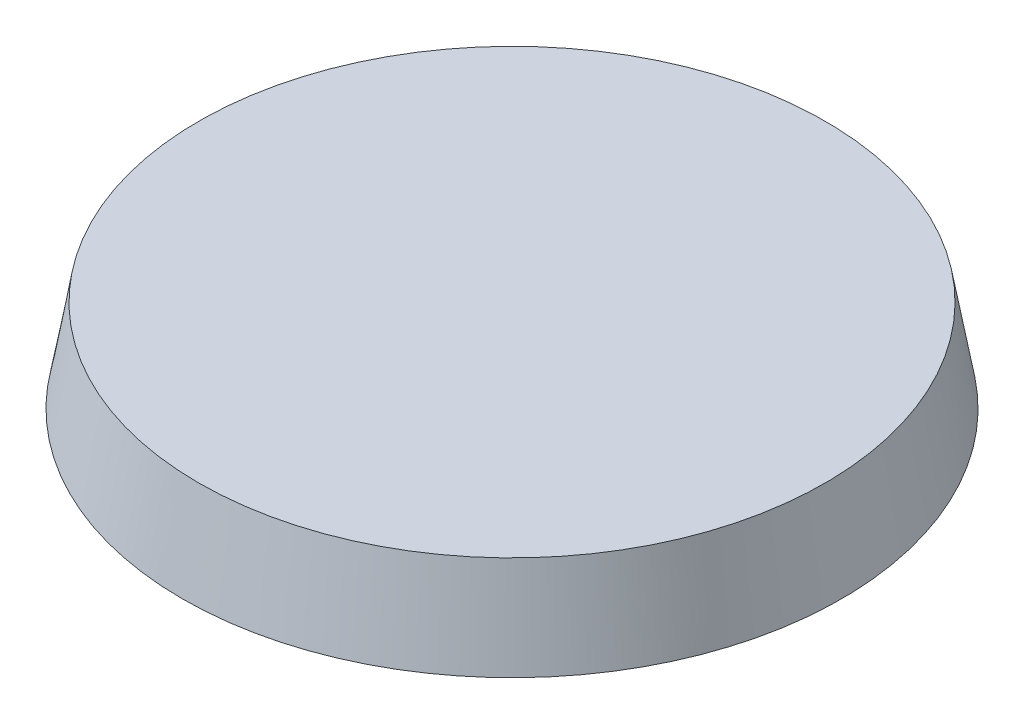
ISO-10303-21;
HEADER;
FILE_DESCRIPTION(('STEP AP214'),'2;1');
FILE_NAME('part.step','',(''),(''),'','','');
FILE_SCHEMA(('AUTOMOTIVE_DESIGN { 1 0 10303 214 1 1 1 1 }'));
ENDSEC;
DATA;
#1=APPLICATION_CONTEXT('core data for automotive mechanical design processes');
#2=APPLICATION_PROTOCOL_DEFINITION('international standard','automotive_design',2000,#1);
#3=PRODUCT_CONTEXT('',#1,'mechanical');
#4=PRODUCT('Part','Part','',(#3));
#5=PRODUCT_RELATED_PRODUCT_CATEGORY('part','',(#4));
#6=PRODUCT_DEFINITION_FORMATION('','',#4);
#7=PRODUCT_DEFINITION_CONTEXT('part definition',#1,'design');
#8=PRODUCT_DEFINITION('design','',#6,#7);
#9=PRODUCT_DEFINITION_SHAPE('','',#8);
#10=(LENGTH_UNIT() NAMED_UNIT(*) SI_UNIT(.MILLI.,.METRE.));
#11=(NAMED_UNIT(*) PLANE_ANGLE_UNIT() SI_UNIT($,.RADIAN.));
#12=(NAMED_UNIT(*) SI_UNIT($,.STERADIAN.) SOLID_ANGLE_UNIT());
#13=UNCERTAINTY_MEASURE_WITH_UNIT(LENGTH_MEASURE(1.E-05),#10,'distance_accuracy_value','');
#14=(GEOMETRIC_REPRESENTATION_CONTEXT(3) GLOBAL_UNCERTAINTY_ASSIGNED_CONTEXT((#13)) GLOBAL_UNIT_ASSIGNED_CONTEXT((#10,
#11,#12)) REPRESENTATION_CONTEXT('',''));
#15=CARTESIAN_POINT('',(0.,0.,0.));
#16=DIRECTION('',(0.,0.,1.));
#17=DIRECTION('',(1.,0.,0.));
#18=AXIS2_PLACEMENT_3D('',#15,#16,#17);
#19=CARTESIAN_POINT('',(0.,0.,0.));
#20=DIRECTION('',(0.,-1.,0.));
#21=DIRECTION('',(0.,0.,1.));
#22=AXIS2_PLACEMENT_3D('',#19,#20,#21);
#23=CONICAL_SURFACE('',#22,12.5,0.174532925199433);
#24=CARTESIAN_POINT('',(0.,3.5,0.));
#25=DIRECTION('',(0.,1.,0.));
#26=DIRECTION('',(0.,0.,1.));
#27=AXIS2_PLACEMENT_3D('',#24,#25,#26);
#28=CIRCLE('',#27,11.8828555675204);
#29=CARTESIAN_POINT('',(0.,3.5,11.8828555675204));
#30=VERTEX_POINT('',#29);
#31=EDGE_CURVE('E10',#30,#30,#28,.T.);
#32=ORIENTED_EDGE('',*,*,#31,.F.);
#33=EDGE_LOOP('',(#32));
#34=FACE_BOUND('',#33,.T.);
#35=CARTESIAN_POINT('',(0.,0.,0.));
#36=DIRECTION('',(0.,1.,0.));
#37=DIRECTION('',(0.,0.,1.));
#38=AXIS2_PLACEMENT_3D('',#35,#36,#37);
#39=CIRCLE('',#38,12.5);
#40=CARTESIAN_POINT('',(0.,0.,12.5));
#41=VERTEX_POINT('',#40);
#42=EDGE_CURVE('E39',#41,#41,#39,.T.);
#43=ORIENTED_EDGE('',*,*,#42,.T.);
#44=EDGE_LOOP('',(#43));
#45=FACE_BOUND('',#44,.T.);
#46=ADVANCED_FACE('F33',(#34,#45),#23,.T.);
#47=CARTESIAN_POINT('',(0.,3.5,0.));
#48=DIRECTION('',(0.,1.,0.));
#49=DIRECTION('',(0.,0.,1.));
#50=AXIS2_PLACEMENT_3D('',#47,#48,#49);
#51=PLANE('',#50);
#52=ORIENTED_EDGE('',*,*,#31,.T.);
#53=EDGE_LOOP('',(#52));
#54=FACE_BOUND('',#53,.T.);
#55=ADVANCED_FACE('F48',(#54),#51,.T.);
#56=CARTESIAN_POINT('',(0.,0.,0.));
#57=DIRECTION('',(0.,1.,0.));
#58=DIRECTION('',(0.,0.,1.));
#59=AXIS2_PLACEMENT_3D('',#56,#57,#58);
#60=PLANE('',#59);
#61=ORIENTED_EDGE('',*,*,#42,.F.);
#62=EDGE_LOOP('',(#61));
#63=FACE_BOUND('',#62,.T.);
#64=ADVANCED_FACE('F46',(#63),#60,.F.);
#65=CLOSED_SHELL('',(#46,#55,#64));
#66=MANIFOLD_SOLID_BREP('B2',#65);
#67=ADVANCED_BREP_SHAPE_REPRESENTATION('',(#18,#66),#14);
#68=SHAPE_DEFINITION_REPRESENTATION(#9,#67);
ENDSEC;
END-ISO-10303-21;
